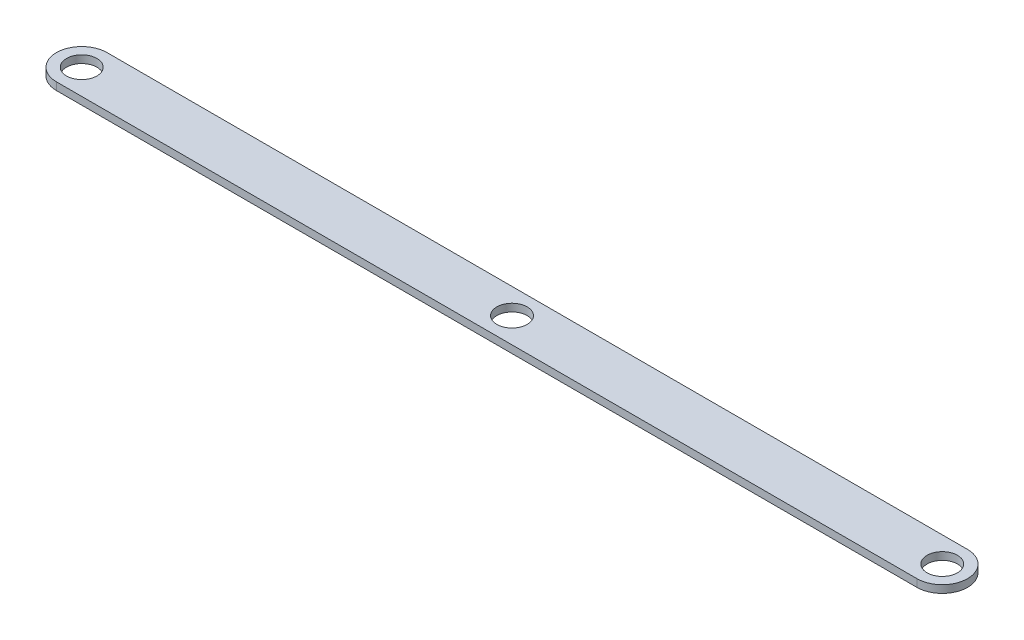
ISO-10303-21;
HEADER;
FILE_DESCRIPTION(('STEP AP214'),'2;1');
FILE_NAME('part.step','',(''),(''),'','','');
FILE_SCHEMA(('AUTOMOTIVE_DESIGN { 1 0 10303 214 1 1 1 1 }'));
ENDSEC;
DATA;
#1=APPLICATION_CONTEXT('core data for automotive mechanical design processes');
#2=APPLICATION_PROTOCOL_DEFINITION('international standard','automotive_design',2000,#1);
#3=PRODUCT_CONTEXT('',#1,'mechanical');
#4=PRODUCT('Part','Part','',(#3));
#5=PRODUCT_RELATED_PRODUCT_CATEGORY('part','',(#4));
#6=PRODUCT_DEFINITION_FORMATION('','',#4);
#7=PRODUCT_DEFINITION_CONTEXT('part definition',#1,'design');
#8=PRODUCT_DEFINITION('design','',#6,#7);
#9=PRODUCT_DEFINITION_SHAPE('','',#8);
#10=(LENGTH_UNIT() NAMED_UNIT(*) SI_UNIT(.MILLI.,.METRE.));
#11=(NAMED_UNIT(*) PLANE_ANGLE_UNIT() SI_UNIT($,.RADIAN.));
#12=(NAMED_UNIT(*) SI_UNIT($,.STERADIAN.) SOLID_ANGLE_UNIT());
#13=UNCERTAINTY_MEASURE_WITH_UNIT(LENGTH_MEASURE(1.E-05),#10,'distance_accuracy_value','');
#14=(GEOMETRIC_REPRESENTATION_CONTEXT(3) GLOBAL_UNCERTAINTY_ASSIGNED_CONTEXT((#13)) GLOBAL_UNIT_ASSIGNED_CONTEXT((#10,
#11,#12)) REPRESENTATION_CONTEXT('',''));
#15=CARTESIAN_POINT('',(0.,0.,0.));
#16=DIRECTION('',(0.,0.,1.));
#17=DIRECTION('',(1.,0.,0.));
#18=AXIS2_PLACEMENT_3D('',#15,#16,#17);
#19=CARTESIAN_POINT('',(-62.687563754482,3.,-5.85714285714286));
#20=DIRECTION('',(0.,1.,0.));
#21=DIRECTION('',(0.,0.,1.));
#22=AXIS2_PLACEMENT_3D('',#19,#20,#21);
#23=PLANE('',#22);
#24=CARTESIAN_POINT('',(277.312436245518,3.,-5.85714285714286));
#25=DIRECTION('',(0.,1.,0.));
#26=DIRECTION('',(0.,0.,1.));
#27=AXIS2_PLACEMENT_3D('',#24,#25,#26);
#28=CIRCLE('',#27,5.99999999999999);
#29=CARTESIAN_POINT('',(277.312436245518,3.,0.142857142857124));
#30=VERTEX_POINT('',#29);
#31=EDGE_CURVE('E134',#30,#30,#28,.T.);
#32=ORIENTED_EDGE('',*,*,#31,.F.);
#33=EDGE_LOOP('',(#32));
#34=FACE_BOUND('',#33,.T.);
#35=CARTESIAN_POINT('',(-62.687563754482,3.,-5.85714285714286));
#36=DIRECTION('',(0.,1.,0.));
#37=DIRECTION('',(0.,0.,1.));
#38=AXIS2_PLACEMENT_3D('',#35,#36,#37);
#39=CIRCLE('',#38,10.);
#40=CARTESIAN_POINT('',(-62.687563754482,3.,-15.8571428571429));
#41=VERTEX_POINT('',#40);
#42=CARTESIAN_POINT('',(-62.687563754482,3.,4.14285714285714));
#43=VERTEX_POINT('',#42);
#44=EDGE_CURVE('E92',#41,#43,#39,.T.);
#45=ORIENTED_EDGE('',*,*,#44,.T.);
#46=DIRECTION('',(1.,0.,0.));
#47=VECTOR('',#46,1.);
#48=CARTESIAN_POINT('',(-62.687563754482,3.,4.14285714285714));
#49=LINE('',#48,#47);
#50=CARTESIAN_POINT('',(277.312436245518,3.,4.14285714285713));
#51=VERTEX_POINT('',#50);
#52=EDGE_CURVE('E87',#43,#51,#49,.T.);
#53=ORIENTED_EDGE('',*,*,#52,.T.);
#54=CARTESIAN_POINT('',(277.312436245518,3.,-5.85714285714286));
#55=DIRECTION('',(0.,1.,0.));
#56=DIRECTION('',(0.,0.,1.));
#57=AXIS2_PLACEMENT_3D('',#54,#55,#56);
#58=CIRCLE('',#57,10.);
#59=CARTESIAN_POINT('',(277.312436245518,3.,-15.8571428571429));
#60=VERTEX_POINT('',#59);
#61=EDGE_CURVE('E90',#51,#60,#58,.T.);
#62=ORIENTED_EDGE('',*,*,#61,.T.);
#63=DIRECTION('',(-1.,0.,0.));
#64=VECTOR('',#63,1.);
#65=CARTESIAN_POINT('',(-62.687563754482,3.,-15.8571428571429));
#66=LINE('',#65,#64);
#67=EDGE_CURVE('E57',#60,#41,#66,.T.);
#68=ORIENTED_EDGE('',*,*,#67,.T.);
#69=EDGE_LOOP('',(#45,#53,#62,#68));
#70=FACE_BOUND('',#69,.T.);
#71=CARTESIAN_POINT('',(-62.687563754482,3.,-5.85714285714286));
#72=DIRECTION('',(0.,1.,0.));
#73=DIRECTION('',(0.,0.,1.));
#74=AXIS2_PLACEMENT_3D('',#71,#72,#73);
#75=CIRCLE('',#74,6.);
#76=CARTESIAN_POINT('',(-62.687563754482,3.,0.142857142857137));
#77=VERTEX_POINT('',#76);
#78=EDGE_CURVE('E112',#77,#77,#75,.T.);
#79=ORIENTED_EDGE('',*,*,#78,.F.);
#80=EDGE_LOOP('',(#79));
#81=FACE_BOUND('',#80,.T.);
#82=CARTESIAN_POINT('',(107.312436245518,3.,-5.85714285714286));
#83=DIRECTION('',(0.,1.,0.));
#84=DIRECTION('',(0.,0.,1.));
#85=AXIS2_PLACEMENT_3D('',#82,#83,#84);
#86=CIRCLE('',#85,6.);
#87=CARTESIAN_POINT('',(107.312436245518,3.,0.142857142857138));
#88=VERTEX_POINT('',#87);
#89=EDGE_CURVE('E142',#88,#88,#86,.T.);
#90=ORIENTED_EDGE('',*,*,#89,.F.);
#91=EDGE_LOOP('',(#90));
#92=FACE_BOUND('',#91,.T.);
#93=ADVANCED_FACE('F39',(#34,#70,#81,#92),#23,.T.);
#94=CARTESIAN_POINT('',(-62.687563754482,0.,-5.85714285714286));
#95=DIRECTION('',(0.,1.,0.));
#96=DIRECTION('',(0.,0.,1.));
#97=AXIS2_PLACEMENT_3D('',#94,#95,#96);
#98=PLANE('',#97);
#99=CARTESIAN_POINT('',(-62.687563754482,0.,-5.85714285714286));
#100=DIRECTION('',(0.,1.,0.));
#101=DIRECTION('',(0.,0.,1.));
#102=AXIS2_PLACEMENT_3D('',#99,#100,#101);
#103=CIRCLE('',#102,10.);
#104=CARTESIAN_POINT('',(-62.687563754482,0.,-15.8571428571429));
#105=VERTEX_POINT('',#104);
#106=CARTESIAN_POINT('',(-62.687563754482,0.,4.14285714285714));
#107=VERTEX_POINT('',#106);
#108=EDGE_CURVE('E108',#105,#107,#103,.T.);
#109=ORIENTED_EDGE('',*,*,#108,.F.);
#110=DIRECTION('',(-1.,0.,0.));
#111=VECTOR('',#110,1.);
#112=CARTESIAN_POINT('',(-62.687563754482,0.,-15.8571428571429));
#113=LINE('',#112,#111);
#114=CARTESIAN_POINT('',(277.312436245518,0.,-15.8571428571429));
#115=VERTEX_POINT('',#114);
#116=EDGE_CURVE('E80',#115,#105,#113,.T.);
#117=ORIENTED_EDGE('',*,*,#116,.F.);
#118=CARTESIAN_POINT('',(277.312436245518,0.,-5.85714285714286));
#119=DIRECTION('',(0.,1.,0.));
#120=DIRECTION('',(0.,0.,1.));
#121=AXIS2_PLACEMENT_3D('',#118,#119,#120);
#122=CIRCLE('',#121,10.);
#123=CARTESIAN_POINT('',(277.312436245518,0.,4.14285714285713));
#124=VERTEX_POINT('',#123);
#125=EDGE_CURVE('E74',#124,#115,#122,.T.);
#126=ORIENTED_EDGE('',*,*,#125,.F.);
#127=DIRECTION('',(1.,0.,0.));
#128=VECTOR('',#127,1.);
#129=CARTESIAN_POINT('',(-62.687563754482,0.,4.14285714285714));
#130=LINE('',#129,#128);
#131=EDGE_CURVE('E97',#107,#124,#130,.T.);
#132=ORIENTED_EDGE('',*,*,#131,.F.);
#133=EDGE_LOOP('',(#109,#117,#126,#132));
#134=FACE_BOUND('',#133,.T.);
#135=CARTESIAN_POINT('',(-62.687563754482,0.,-5.85714285714286));
#136=DIRECTION('',(0.,1.,0.));
#137=DIRECTION('',(0.,0.,1.));
#138=AXIS2_PLACEMENT_3D('',#135,#136,#137);
#139=CIRCLE('',#138,6.);
#140=CARTESIAN_POINT('',(-62.687563754482,0.,0.142857142857137));
#141=VERTEX_POINT('',#140);
#142=EDGE_CURVE('E130',#141,#141,#139,.T.);
#143=ORIENTED_EDGE('',*,*,#142,.T.);
#144=EDGE_LOOP('',(#143));
#145=FACE_BOUND('',#144,.T.);
#146=CARTESIAN_POINT('',(277.312436245518,0.,-5.85714285714286));
#147=DIRECTION('',(0.,1.,0.));
#148=DIRECTION('',(0.,0.,1.));
#149=AXIS2_PLACEMENT_3D('',#146,#147,#148);
#150=CIRCLE('',#149,5.99999999999999);
#151=CARTESIAN_POINT('',(277.312436245518,0.,0.142857142857124));
#152=VERTEX_POINT('',#151);
#153=EDGE_CURVE('E138',#152,#152,#150,.T.);
#154=ORIENTED_EDGE('',*,*,#153,.T.);
#155=EDGE_LOOP('',(#154));
#156=FACE_BOUND('',#155,.T.);
#157=CARTESIAN_POINT('',(107.312436245518,0.,-5.85714285714286));
#158=DIRECTION('',(0.,1.,0.));
#159=DIRECTION('',(0.,0.,1.));
#160=AXIS2_PLACEMENT_3D('',#157,#158,#159);
#161=CIRCLE('',#160,6.);
#162=CARTESIAN_POINT('',(107.312436245518,0.,0.142857142857138));
#163=VERTEX_POINT('',#162);
#164=EDGE_CURVE('E146',#163,#163,#161,.T.);
#165=ORIENTED_EDGE('',*,*,#164,.T.);
#166=EDGE_LOOP('',(#165));
#167=FACE_BOUND('',#166,.T.);
#168=ADVANCED_FACE('F125',(#134,#145,#156,#167),#98,.F.);
#169=CARTESIAN_POINT('',(-62.687563754482,3.,-5.85714285714286));
#170=DIRECTION('',(0.,-1.,0.));
#171=DIRECTION('',(0.,0.,-1.));
#172=AXIS2_PLACEMENT_3D('',#169,#170,#171);
#173=CYLINDRICAL_SURFACE('',#172,10.);
#174=ORIENTED_EDGE('',*,*,#108,.T.);
#175=DIRECTION('',(0.,-1.,0.));
#176=VECTOR('',#175,1.);
#177=CARTESIAN_POINT('',(-62.687563754482,3.,4.14285714285714));
#178=LINE('',#177,#176);
#179=EDGE_CURVE('E11',#43,#107,#178,.T.);
#180=ORIENTED_EDGE('',*,*,#179,.F.);
#181=ORIENTED_EDGE('',*,*,#44,.F.);
#182=DIRECTION('',(0.,-1.,0.));
#183=VECTOR('',#182,1.);
#184=CARTESIAN_POINT('',(-62.687563754482,3.,-15.8571428571429));
#185=LINE('',#184,#183);
#186=EDGE_CURVE('E104',#41,#105,#185,.T.);
#187=ORIENTED_EDGE('',*,*,#186,.T.);
#188=EDGE_LOOP('',(#174,#180,#181,#187));
#189=FACE_BOUND('',#188,.T.);
#190=ADVANCED_FACE('F41',(#189),#173,.T.);
#191=CARTESIAN_POINT('',(-62.687563754482,3.,4.14285714285714));
#192=DIRECTION('',(0.,0.,-1.));
#193=DIRECTION('',(-1.,0.,0.));
#194=AXIS2_PLACEMENT_3D('',#191,#192,#193);
#195=PLANE('',#194);
#196=ORIENTED_EDGE('',*,*,#131,.T.);
#197=DIRECTION('',(0.,-1.,0.));
#198=VECTOR('',#197,1.);
#199=CARTESIAN_POINT('',(277.312436245518,3.,4.14285714285713));
#200=LINE('',#199,#198);
#201=EDGE_CURVE('E49',#51,#124,#200,.T.);
#202=ORIENTED_EDGE('',*,*,#201,.F.);
#203=ORIENTED_EDGE('',*,*,#52,.F.);
#204=ORIENTED_EDGE('',*,*,#179,.T.);
#205=EDGE_LOOP('',(#196,#202,#203,#204));
#206=FACE_BOUND('',#205,.T.);
#207=ADVANCED_FACE('F96',(#206),#195,.F.);
#208=CARTESIAN_POINT('',(277.312436245518,3.,-5.85714285714286));
#209=DIRECTION('',(0.,-1.,0.));
#210=DIRECTION('',(0.,0.,-1.));
#211=AXIS2_PLACEMENT_3D('',#208,#209,#210);
#212=CYLINDRICAL_SURFACE('',#211,10.);
#213=ORIENTED_EDGE('',*,*,#125,.T.);
#214=DIRECTION('',(0.,-1.,0.));
#215=VECTOR('',#214,1.);
#216=CARTESIAN_POINT('',(277.312436245518,3.,-15.8571428571429));
#217=LINE('',#216,#215);
#218=EDGE_CURVE('E99',#60,#115,#217,.T.);
#219=ORIENTED_EDGE('',*,*,#218,.F.);
#220=ORIENTED_EDGE('',*,*,#61,.F.);
#221=ORIENTED_EDGE('',*,*,#201,.T.);
#222=EDGE_LOOP('',(#213,#219,#220,#221));
#223=FACE_BOUND('',#222,.T.);
#224=ADVANCED_FACE('F100',(#223),#212,.T.);
#225=CARTESIAN_POINT('',(-62.687563754482,3.,-15.8571428571429));
#226=DIRECTION('',(0.,0.,1.));
#227=DIRECTION('',(1.,0.,0.));
#228=AXIS2_PLACEMENT_3D('',#225,#226,#227);
#229=PLANE('',#228);
#230=ORIENTED_EDGE('',*,*,#116,.T.);
#231=ORIENTED_EDGE('',*,*,#186,.F.);
#232=ORIENTED_EDGE('',*,*,#67,.F.);
#233=ORIENTED_EDGE('',*,*,#218,.T.);
#234=EDGE_LOOP('',(#230,#231,#232,#233));
#235=FACE_BOUND('',#234,.T.);
#236=ADVANCED_FACE('F122',(#235),#229,.F.);
#237=CARTESIAN_POINT('',(-62.687563754482,3.,-5.85714285714286));
#238=DIRECTION('',(0.,-1.,0.));
#239=DIRECTION('',(0.,0.,-1.));
#240=AXIS2_PLACEMENT_3D('',#237,#238,#239);
#241=CYLINDRICAL_SURFACE('',#240,6.);
#242=ORIENTED_EDGE('',*,*,#78,.T.);
#243=EDGE_LOOP('',(#242));
#244=FACE_BOUND('',#243,.T.);
#245=ORIENTED_EDGE('',*,*,#142,.F.);
#246=EDGE_LOOP('',(#245));
#247=FACE_BOUND('',#246,.T.);
#248=ADVANCED_FACE('F166',(#244,#247),#241,.F.);
#249=CARTESIAN_POINT('',(277.312436245518,3.,-5.85714285714286));
#250=DIRECTION('',(0.,-1.,0.));
#251=DIRECTION('',(0.,0.,-1.));
#252=AXIS2_PLACEMENT_3D('',#249,#250,#251);
#253=CYLINDRICAL_SURFACE('',#252,5.99999999999999);
#254=ORIENTED_EDGE('',*,*,#31,.T.);
#255=EDGE_LOOP('',(#254));
#256=FACE_BOUND('',#255,.T.);
#257=ORIENTED_EDGE('',*,*,#153,.F.);
#258=EDGE_LOOP('',(#257));
#259=FACE_BOUND('',#258,.T.);
#260=ADVANCED_FACE('F212',(#256,#259),#253,.F.);
#261=CARTESIAN_POINT('',(107.312436245518,3.,-5.85714285714286));
#262=DIRECTION('',(0.,-1.,0.));
#263=DIRECTION('',(0.,0.,-1.));
#264=AXIS2_PLACEMENT_3D('',#261,#262,#263);
#265=CYLINDRICAL_SURFACE('',#264,6.);
#266=ORIENTED_EDGE('',*,*,#89,.T.);
#267=EDGE_LOOP('',(#266));
#268=FACE_BOUND('',#267,.T.);
#269=ORIENTED_EDGE('',*,*,#164,.F.);
#270=EDGE_LOOP('',(#269));
#271=FACE_BOUND('',#270,.T.);
#272=ADVANCED_FACE('F154',(#268,#271),#265,.F.);
#273=CLOSED_SHELL('',(#93,#168,#190,#207,#224,#236,#248,#260,#272));
#274=MANIFOLD_SOLID_BREP('B2',#273);
#275=ADVANCED_BREP_SHAPE_REPRESENTATION('',(#18,#274),#14);
#276=SHAPE_DEFINITION_REPRESENTATION(#9,#275);
ENDSEC;
END-ISO-10303-21;
